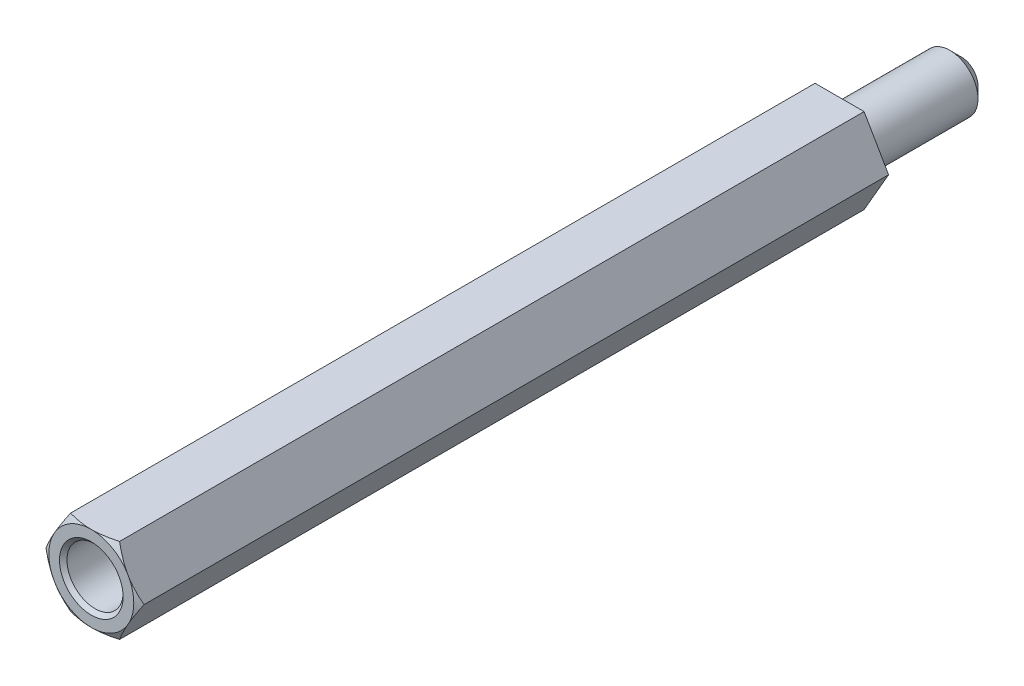
ISO-10303-21;
HEADER;
FILE_DESCRIPTION(('STEP AP214'),'2;1');
FILE_NAME('part.step','',(''),(''),'','','');
FILE_SCHEMA(('AUTOMOTIVE_DESIGN { 1 0 10303 214 1 1 1 1 }'));
ENDSEC;
DATA;
#1=APPLICATION_CONTEXT('core data for automotive mechanical design processes');
#2=APPLICATION_PROTOCOL_DEFINITION('international standard','automotive_design',2000,#1);
#3=PRODUCT_CONTEXT('',#1,'mechanical');
#4=PRODUCT('Part','Part','',(#3));
#5=PRODUCT_RELATED_PRODUCT_CATEGORY('part','',(#4));
#6=PRODUCT_DEFINITION_FORMATION('','',#4);
#7=PRODUCT_DEFINITION_CONTEXT('part definition',#1,'design');
#8=PRODUCT_DEFINITION('design','',#6,#7);
#9=PRODUCT_DEFINITION_SHAPE('','',#8);
#10=(LENGTH_UNIT() NAMED_UNIT(*) SI_UNIT(.MILLI.,.METRE.));
#11=(NAMED_UNIT(*) PLANE_ANGLE_UNIT() SI_UNIT($,.RADIAN.));
#12=(NAMED_UNIT(*) SI_UNIT($,.STERADIAN.) SOLID_ANGLE_UNIT());
#13=UNCERTAINTY_MEASURE_WITH_UNIT(LENGTH_MEASURE(1.E-05),#10,'distance_accuracy_value','');
#14=(GEOMETRIC_REPRESENTATION_CONTEXT(3) GLOBAL_UNCERTAINTY_ASSIGNED_CONTEXT((#13)) GLOBAL_UNIT_ASSIGNED_CONTEXT((#10,
#11,#12)) REPRESENTATION_CONTEXT('',''));
#15=CARTESIAN_POINT('',(0.,0.,0.));
#16=DIRECTION('',(0.,0.,1.));
#17=DIRECTION('',(1.,0.,0.));
#18=AXIS2_PLACEMENT_3D('',#15,#16,#17);
#19=CARTESIAN_POINT('',(0.,0.,40.));
#20=DIRECTION('',(0.,0.,1.));
#21=DIRECTION('',(1.,0.,0.));
#22=AXIS2_PLACEMENT_3D('',#19,#20,#21);
#23=PLANE('',#22);
#24=CARTESIAN_POINT('',(0.,0.,40.));
#25=DIRECTION('',(0.,0.,1.));
#26=DIRECTION('',(1.,0.,0.));
#27=AXIS2_PLACEMENT_3D('',#24,#25,#26);
#28=CIRCLE('',#27,1.7);
#29=CARTESIAN_POINT('',(1.7,0.,40.));
#30=VERTEX_POINT('',#29);
#31=EDGE_CURVE('E166',#30,#30,#28,.F.);
#32=ORIENTED_EDGE('',*,*,#31,.T.);
#33=EDGE_LOOP('',(#32));
#34=FACE_BOUND('',#33,.T.);
#35=CARTESIAN_POINT('',(0.,0.,40.));
#36=DIRECTION('',(0.,0.,1.));
#37=DIRECTION('',(1.,0.,0.));
#38=AXIS2_PLACEMENT_3D('',#35,#36,#37);
#39=CIRCLE('',#38,2.2711702221209);
#40=CARTESIAN_POINT('',(1.92942846272878,-1.19813187298426,40.));
#41=VERTEX_POINT('',#40);
#42=CARTESIAN_POINT('',(0.0728984077241233,-2.27,40.));
#43=VERTEX_POINT('',#42);
#44=EDGE_CURVE('E165',#41,#43,#39,.F.);
#45=ORIENTED_EDGE('',*,*,#44,.F.);
#46=DIRECTION('',(0.499999999999995,0.866025403784442,0.));
#47=VECTOR('',#46,1.);
#48=CARTESIAN_POINT('',(1.31058511106048,-2.26999999999999,40.));
#49=LINE('',#48,#47);
#50=CARTESIAN_POINT('',(2.0023268704526,-1.07186812701572,40.));
#51=VERTEX_POINT('',#50);
#52=EDGE_CURVE('E309',#41,#51,#49,.T.);
#53=ORIENTED_EDGE('',*,*,#52,.T.);
#54=CARTESIAN_POINT('',(2.00232687045273,1.07186812701549,40.));
#55=VERTEX_POINT('',#54);
#56=EDGE_CURVE('E162',#55,#51,#39,.F.);
#57=ORIENTED_EDGE('',*,*,#56,.F.);
#58=DIRECTION('',(-0.500000000000001,0.866025403784438,0.));
#59=VECTOR('',#58,1.);
#60=CARTESIAN_POINT('',(2.6211702221209,0.,40.));
#61=LINE('',#60,#59);
#62=CARTESIAN_POINT('',(1.92942846272862,1.19813187298452,40.));
#63=VERTEX_POINT('',#62);
#64=EDGE_CURVE('E321',#55,#63,#61,.T.);
#65=ORIENTED_EDGE('',*,*,#64,.T.);
#66=CARTESIAN_POINT('',(0.0728984077240917,2.27,40.));
#67=VERTEX_POINT('',#66);
#68=EDGE_CURVE('E164',#67,#63,#39,.F.);
#69=ORIENTED_EDGE('',*,*,#68,.F.);
#70=DIRECTION('',(-1.,0.,0.));
#71=VECTOR('',#70,1.);
#72=CARTESIAN_POINT('',(1.31058511106045,2.27,40.));
#73=LINE('',#72,#71);
#74=CARTESIAN_POINT('',(-0.0728984077241075,2.27,40.));
#75=VERTEX_POINT('',#74);
#76=EDGE_CURVE('E316',#67,#75,#73,.T.);
#77=ORIENTED_EDGE('',*,*,#76,.T.);
#78=CARTESIAN_POINT('',(-1.92942846272863,1.19813187298449,40.));
#79=VERTEX_POINT('',#78);
#80=EDGE_CURVE('E341',#79,#75,#39,.F.);
#81=ORIENTED_EDGE('',*,*,#80,.F.);
#82=DIRECTION('',(-0.499999999999995,-0.866025403784442,0.));
#83=VECTOR('',#82,1.);
#84=CARTESIAN_POINT('',(-1.31058511106046,2.27,40.));
#85=LINE('',#84,#83);
#86=CARTESIAN_POINT('',(-2.00232687045273,1.07186812701548,40.));
#87=VERTEX_POINT('',#86);
#88=EDGE_CURVE('E315',#79,#87,#85,.T.);
#89=ORIENTED_EDGE('',*,*,#88,.T.);
#90=CARTESIAN_POINT('',(-2.00232687045272,-1.0718681270155,40.));
#91=VERTEX_POINT('',#90);
#92=EDGE_CURVE('E126',#91,#87,#39,.F.);
#93=ORIENTED_EDGE('',*,*,#92,.F.);
#94=DIRECTION('',(0.500000000000007,-0.866025403784435,0.));
#95=VECTOR('',#94,1.);
#96=CARTESIAN_POINT('',(-2.6211702221209,0.,40.));
#97=LINE('',#96,#95);
#98=CARTESIAN_POINT('',(-1.92942846272861,-1.19813187298453,40.));
#99=VERTEX_POINT('',#98);
#100=EDGE_CURVE('E142',#91,#99,#97,.T.);
#101=ORIENTED_EDGE('',*,*,#100,.T.);
#102=CARTESIAN_POINT('',(-0.0728984077240759,-2.27,40.));
#103=VERTEX_POINT('',#102);
#104=EDGE_CURVE('E332',#103,#99,#39,.F.);
#105=ORIENTED_EDGE('',*,*,#104,.F.);
#106=DIRECTION('',(1.,0.,0.));
#107=VECTOR('',#106,1.);
#108=CARTESIAN_POINT('',(-1.31058511106043,-2.27000000000001,40.));
#109=LINE('',#108,#107);
#110=EDGE_CURVE('E301',#103,#43,#109,.T.);
#111=ORIENTED_EDGE('',*,*,#110,.T.);
#112=EDGE_LOOP('',(#45,#53,#57,#65,#69,#77,#81,#89,#93,#101,#105,#111));
#113=FACE_BOUND('',#112,.T.);
#114=ADVANCED_FACE('F37',(#34,#113),#23,.T.);
#115=CARTESIAN_POINT('',(1.31058511106048,-2.26999999999999,40.));
#116=DIRECTION('',(-0.866025403784442,0.499999999999995,0.));
#117=DIRECTION('',(-0.499999999999995,-0.866025403784442,0.));
#118=AXIS2_PLACEMENT_3D('',#115,#116,#117);
#119=PLANE('',#118);
#120=DIRECTION('',(0.,0.,-1.));
#121=VECTOR('',#120,1.);
#122=CARTESIAN_POINT('',(2.6211702221209,0.,40.));
#123=LINE('',#122,#121);
#124=CARTESIAN_POINT('',(2.6211702221209,0.,39.8));
#125=VERTEX_POINT('',#124);
#126=CARTESIAN_POINT('',(2.6211702221209,0.,0.));
#127=VERTEX_POINT('',#126);
#128=EDGE_CURVE('E160',#125,#127,#123,.T.);
#129=ORIENTED_EDGE('',*,*,#128,.F.);
#130=CARTESIAN_POINT('',(3.53192502802619,1.5774735970655,39.0874155357182));
#131=CARTESIAN_POINT('',(3.49038683177578,1.50552733070503,39.1258459368283));
#132=CARTESIAN_POINT('',(3.44875020540645,1.43341057837759,39.1638565423729));
#133=CARTESIAN_POINT('',(3.36523806633925,1.28876331046445,39.2388408708484));
#134=CARTESIAN_POINT('',(3.32336252393505,1.21623274342586,39.2758144613019));
#135=CARTESIAN_POINT('',(3.2392041639013,1.07046618796573,39.3486360571844));
#136=CARTESIAN_POINT('',(3.19692046373752,0.997228670950058,39.3844800017565));
#137=CARTESIAN_POINT('',(3.11203872815441,0.850209192285474,39.4546361454567));
#138=CARTESIAN_POINT('',(3.06944070287604,0.776427248201232,39.4889483937519));
#139=CARTESIAN_POINT('',(2.93902958582734,0.550548567601064,39.5907324723442));
#140=CARTESIAN_POINT('',(2.85063034563924,0.39743659224479,39.6552582519314));
#141=CARTESIAN_POINT('',(2.67192637782697,0.0879122404797823,39.7724545253547));
#142=CARTESIAN_POINT('',(2.58162393222904,-0.0684961833435547,39.8251384219436));
#143=CARTESIAN_POINT('',(2.42693241398783,-0.336429752437294,39.8992654299313));
#144=CARTESIAN_POINT('',(2.36310804900723,-0.44697679534452,39.9253337082215));
#145=CARTESIAN_POINT('',(2.23458545503782,-0.669584458020097,39.9666715963234));
#146=CARTESIAN_POINT('',(2.16988756118547,-0.781644497315052,39.9819452339838));
#147=CARTESIAN_POINT('',(2.04077595171338,-1.00527236476771,39.9998836306583));
#148=CARTESIAN_POINT('',(1.97636731130573,-1.1168314024002,40.0026891812466));
#149=CARTESIAN_POINT('',(1.84772217135019,-1.33965132095001,39.9957318097908));
#150=CARTESIAN_POINT('',(1.78348569252727,-1.45091216597063,39.9859674371621));
#151=CARTESIAN_POINT('',(1.63030365883246,-1.71623123113677,39.948841102754));
#152=CARTESIAN_POINT('',(1.54169424329176,-1.86970724088224,39.9160238630181));
#153=CARTESIAN_POINT('',(1.36642171508062,-2.17328816491499,39.8337386865889));
#154=CARTESIAN_POINT('',(1.27976131396277,-2.3233883826554,39.7842489190442));
#155=CARTESIAN_POINT('',(1.10733311832963,-2.62204277814944,39.6734296043507));
#156=CARTESIAN_POINT('',(1.02158612689549,-2.77056092390955,39.6119739052285));
#157=CARTESIAN_POINT('',(0.851622526986697,-3.06494651438889,39.4814839194209));
#158=CARTESIAN_POINT('',(0.76740515390728,-3.21081528344242,39.4124535477672));
#159=CARTESIAN_POINT('',(0.635892107966404,-3.43860256087016,39.2999058489882));
#160=CARTESIAN_POINT('',(0.588222071353319,-3.5211694862827,39.258115008667));
#161=CARTESIAN_POINT('',(0.493605207664309,-3.68505070144488,39.1735241810497));
#162=CARTESIAN_POINT('',(0.446655700740953,-3.76636963282644,39.1307361997354));
#163=CARTESIAN_POINT('',(0.399830305155194,-3.84747359706549,39.0874155357182));
#164=B_SPLINE_CURVE_WITH_KNOTS('',3,(#130,#131,#132,#133,#134,#135,#136,#137,#138,#139,#140,
#141,#142,#143,#144,#145,#146,#147,#148,#149,#150,#151,#152,#153,#154,#155,#156,#157,#158,#159,
#160,#161,#162,#163),.UNSPECIFIED.,.F.,.F.,(4,2,2,2,2,2,2,2,2,2,2,2,2,2,2,2,4),(0.,
0.274606048832121,0.549247019939766,0.824783021018256,1.10031017110166,1.66467514911565,
2.22839812072205,2.61888273310892,3.00922156533175,3.39514124414463,3.78110546255824,
4.32061090335238,4.8608255310685,5.40707820220995,5.95304985633501,6.26533246804876,
6.57488685439788),.UNSPECIFIED.);
#165=EDGE_CURVE('E299',#125,#51,#164,.T.);
#166=ORIENTED_EDGE('',*,*,#165,.T.);
#167=ORIENTED_EDGE('',*,*,#52,.F.);
#168=CARTESIAN_POINT('',(1.31058511106048,-2.26999999999999,39.8));
#169=VERTEX_POINT('',#168);
#170=EDGE_CURVE('E143',#41,#169,#164,.T.);
#171=ORIENTED_EDGE('',*,*,#170,.T.);
#172=DIRECTION('',(0.,0.,-1.));
#173=VECTOR('',#172,1.);
#174=CARTESIAN_POINT('',(1.31058511106048,-2.26999999999999,40.));
#175=LINE('',#174,#173);
#176=CARTESIAN_POINT('',(1.31058511106048,-2.26999999999999,0.));
#177=VERTEX_POINT('',#176);
#178=EDGE_CURVE('E155',#169,#177,#175,.T.);
#179=ORIENTED_EDGE('',*,*,#178,.T.);
#180=DIRECTION('',(0.499999999999995,0.866025403784442,0.));
#181=VECTOR('',#180,1.);
#182=CARTESIAN_POINT('',(1.31058511106048,-2.26999999999999,0.));
#183=LINE('',#182,#181);
#184=EDGE_CURVE('E287',#177,#127,#183,.T.);
#185=ORIENTED_EDGE('',*,*,#184,.T.);
#186=EDGE_LOOP('',(#129,#166,#167,#171,#179,#185));
#187=FACE_BOUND('',#186,.T.);
#188=ADVANCED_FACE('F248',(#187),#119,.F.);
#189=CARTESIAN_POINT('',(2.6211702221209,0.,40.));
#190=DIRECTION('',(-0.866025403784438,-0.500000000000001,0.));
#191=DIRECTION('',(0.500000000000001,-0.866025403784438,0.));
#192=AXIS2_PLACEMENT_3D('',#189,#190,#191);
#193=PLANE('',#192);
#194=DIRECTION('',(0.,0.,-1.));
#195=VECTOR('',#194,1.);
#196=CARTESIAN_POINT('',(1.31058511106045,2.27,40.));
#197=LINE('',#196,#195);
#198=CARTESIAN_POINT('',(1.31058511106045,2.27,39.8));
#199=VERTEX_POINT('',#198);
#200=CARTESIAN_POINT('',(1.31058511106045,2.27,0.));
#201=VERTEX_POINT('',#200);
#202=EDGE_CURVE('E153',#199,#201,#197,.T.);
#203=ORIENTED_EDGE('',*,*,#202,.F.);
#204=CARTESIAN_POINT('',(0.399830305155138,3.84747359706553,39.0874155357182));
#205=CARTESIAN_POINT('',(0.441368501405549,3.77552733070505,39.1258459368283));
#206=CARTESIAN_POINT('',(0.483005127774879,3.70341057837761,39.1638565423728));
#207=CARTESIAN_POINT('',(0.566517266842074,3.55876331046447,39.2388408708484));
#208=CARTESIAN_POINT('',(0.608392809246277,3.48623274342588,39.2758144613019));
#209=CARTESIAN_POINT('',(0.69255116928003,3.34046618796575,39.3486360571844));
#210=CARTESIAN_POINT('',(0.734834869443807,3.26722867095008,39.3844800017564));
#211=CARTESIAN_POINT('',(0.819716605026924,3.12020919228549,39.4546361454567));
#212=CARTESIAN_POINT('',(0.862314630305294,3.04642724820125,39.4889483937519));
#213=CARTESIAN_POINT('',(0.992725747353998,2.82054856760109,39.5907324723442));
#214=CARTESIAN_POINT('',(1.0811249875421,2.66743659224481,39.6552582519314));
#215=CARTESIAN_POINT('',(1.25982895535437,2.35791224047981,39.7724545253547));
#216=CARTESIAN_POINT('',(1.3501314009523,2.20150381665647,39.8251384219436));
#217=CARTESIAN_POINT('',(1.50482291919351,1.93357024756273,39.8992654299313));
#218=CARTESIAN_POINT('',(1.56864728417411,1.82302320465551,39.9253337082215));
#219=CARTESIAN_POINT('',(1.69716987814353,1.60041554197993,39.9666715963234));
#220=CARTESIAN_POINT('',(1.76186777199587,1.48835550268498,39.9819452339838));
#221=CARTESIAN_POINT('',(1.89097938146796,1.26472763523233,39.9998836306583));
#222=CARTESIAN_POINT('',(1.95538802187562,1.15316859759983,40.0026891812466));
#223=CARTESIAN_POINT('',(2.08403316183116,0.930348679050027,39.9957318097908));
#224=CARTESIAN_POINT('',(2.14826964065408,0.819087834029409,39.9859674371621));
#225=CARTESIAN_POINT('',(2.30145167434888,0.553768768863273,39.9488411027541));
#226=CARTESIAN_POINT('',(2.39006108988958,0.4002927591178,39.9160238630181));
#227=CARTESIAN_POINT('',(2.56533361810072,0.0967118350850579,39.8337386865889));
#228=CARTESIAN_POINT('',(2.65199401921857,-0.0533883826553456,39.7842489190442));
#229=CARTESIAN_POINT('',(2.82442221485171,-0.352042778149369,39.6734296043507));
#230=CARTESIAN_POINT('',(2.91016920628585,-0.500560923909477,39.6119739052286));
#231=CARTESIAN_POINT('',(3.08013280619464,-0.794946514388809,39.4814839194209));
#232=CARTESIAN_POINT('',(3.16435017927405,-0.94081528344234,39.4124535477672));
#233=CARTESIAN_POINT('',(3.29586322521494,-1.1686025608701,39.2999058489882));
#234=CARTESIAN_POINT('',(3.34353326182804,-1.25116948628265,39.258115008667));
#235=CARTESIAN_POINT('',(3.43815012551707,-1.41505070144488,39.1735241810497));
#236=CARTESIAN_POINT('',(3.48509963244044,-1.49636963282645,39.1307361997354));
#237=CARTESIAN_POINT('',(3.53192502802621,-1.57747359706552,39.0874155357182));
#238=B_SPLINE_CURVE_WITH_KNOTS('',3,(#204,#205,#206,#207,#208,#209,#210,#211,#212,#213,#214,
#215,#216,#217,#218,#219,#220,#221,#222,#223,#224,#225,#226,#227,#228,#229,#230,#231,#232,#233,
#234,#235,#236,#237),.UNSPECIFIED.,.F.,.F.,(4,2,2,2,2,2,2,2,2,2,2,2,2,2,2,2,4),(0.,
0.27460604883212,0.549247019939768,0.824783021018261,1.10031017110167,1.66467514911565,
2.22839812072206,2.61888273310893,3.00922156533175,3.39514124414463,3.78110546255825,
4.32061090335237,4.86082553106847,5.40707820220991,5.95304985633495,6.26533246804878,
6.57488685439797),.UNSPECIFIED.);
#239=EDGE_CURVE('E233',#199,#63,#238,.T.);
#240=ORIENTED_EDGE('',*,*,#239,.T.);
#241=ORIENTED_EDGE('',*,*,#64,.F.);
#242=EDGE_CURVE('E330',#55,#125,#238,.T.);
#243=ORIENTED_EDGE('',*,*,#242,.T.);
#244=ORIENTED_EDGE('',*,*,#128,.T.);
#245=DIRECTION('',(-0.500000000000001,0.866025403784438,0.));
#246=VECTOR('',#245,1.);
#247=CARTESIAN_POINT('',(2.6211702221209,0.,0.));
#248=LINE('',#247,#246);
#249=EDGE_CURVE('E292',#127,#201,#248,.T.);
#250=ORIENTED_EDGE('',*,*,#249,.T.);
#251=EDGE_LOOP('',(#203,#240,#241,#243,#244,#250));
#252=FACE_BOUND('',#251,.T.);
#253=ADVANCED_FACE('F243',(#252),#193,.F.);
#254=CARTESIAN_POINT('',(1.31058511106045,2.27,40.));
#255=DIRECTION('',(0.,-1.,0.));
#256=DIRECTION('',(1.,0.,0.));
#257=AXIS2_PLACEMENT_3D('',#254,#255,#256);
#258=PLANE('',#257);
#259=DIRECTION('',(0.,0.,-1.));
#260=VECTOR('',#259,1.);
#261=CARTESIAN_POINT('',(-1.31058511106046,2.27,40.));
#262=LINE('',#261,#260);
#263=CARTESIAN_POINT('',(-1.31058511106046,2.27,39.8));
#264=VERTEX_POINT('',#263);
#265=CARTESIAN_POINT('',(-1.31058511106046,2.27,0.));
#266=VERTEX_POINT('',#265);
#267=EDGE_CURVE('E150',#264,#266,#262,.T.);
#268=ORIENTED_EDGE('',*,*,#267,.F.);
#269=CARTESIAN_POINT('',(-2.88805870812598,2.26999999999999,39.1987324103344));
#270=CARTESIAN_POINT('',(-2.80547290408561,2.26999999999999,39.2358255324642));
#271=CARTESIAN_POINT('',(-2.72266390787582,2.26999999999999,39.2724300278097));
#272=CARTESIAN_POINT('',(-2.55650266128481,2.26999999999999,39.3444249566602));
#273=CARTESIAN_POINT('',(-2.47315031505662,2.26999999999999,39.3798151686687));
#274=CARTESIAN_POINT('',(-2.30548338672953,2.26999999999999,39.4492769222981));
#275=CARTESIAN_POINT('',(-2.22116623150816,2.26999999999999,39.4833422884396));
#276=CARTESIAN_POINT('',(-2.0518277990544,2.26999999999999,39.5496595457378));
#277=CARTESIAN_POINT('',(-1.96680655448942,2.26999999999999,39.5819115204949));
#278=CARTESIAN_POINT('',(-1.71138311857313,2.26999999999999,39.6750656041859));
#279=CARTESIAN_POINT('',(-1.53976972748373,2.26999999999999,39.7327268658694));
#280=CARTESIAN_POINT('',(-1.19280228070998,2.27,39.8349421604164));
#281=CARTESIAN_POINT('',(-1.01745424532612,2.27,39.879515794802));
#282=CARTESIAN_POINT('',(-0.712090771389087,2.27,39.9400719954737));
#283=CARTESIAN_POINT('',(-0.582987722953622,2.27,39.9605553386303));
#284=CARTESIAN_POINT('',(-0.323439084569052,2.27,39.989581233522));
#285=CARTESIAN_POINT('',(-0.192993977067343,2.27,39.9981279349084));
#286=CARTESIAN_POINT('',(0.06805994543938,2.27,40.0022273630874));
#287=CARTESIAN_POINT('',(0.198668678458185,2.27,39.9977850727737));
#288=CARTESIAN_POINT('',(0.458851198221931,2.27,39.976485692699));
#289=CARTESIAN_POINT('',(0.588424742955681,2.27,39.9596257810572));
#290=CARTESIAN_POINT('',(0.904937752962722,2.27,39.9051607953018));
#291=CARTESIAN_POINT('',(1.09083477493522,2.27,39.8615794043185));
#292=CARTESIAN_POINT('',(1.36639728986909,2.27,39.7844964765957));
#293=CARTESIAN_POINT('',(1.45781153661096,2.27,39.7568102536344));
#294=CARTESIAN_POINT('',(1.63961899594481,2.27000000000001,39.6982591090533));
#295=CARTESIAN_POINT('',(1.73001229033944,2.27000000000001,39.6673944441364));
#296=CARTESIAN_POINT('',(1.9107725748706,2.27000000000001,39.6027837141474));
#297=CARTESIAN_POINT('',(2.00113026057096,2.27000000000001,39.5690119189924));
#298=CARTESIAN_POINT('',(2.18103313876787,2.27000000000001,39.499360278944));
#299=CARTESIAN_POINT('',(2.27057828364603,2.27000000000001,39.4634803114121));
#300=CARTESIAN_POINT('',(2.44846011178725,2.27000000000001,39.3902269588395));
#301=CARTESIAN_POINT('',(2.53680076536778,2.27000000000001,39.352863166806));
#302=CARTESIAN_POINT('',(2.71286376090329,2.27000000000001,39.2767584059864));
#303=CARTESIAN_POINT('',(2.80058623966965,2.27000000000001,39.2380177541729));
#304=CARTESIAN_POINT('',(2.88805870812597,2.27000000000001,39.1987324103344));
#305=B_SPLINE_CURVE_WITH_KNOTS('',3,(#269,#270,#271,#272,#273,#274,#275,#276,#277,#278,#279,
#280,#281,#282,#283,#284,#285,#286,#287,#288,#289,#290,#291,#292,#293,#294,#295,#296,#297,#298,
#299,#300,#301,#302,#303,#304),.UNSPECIFIED.,.F.,.F.,(4,2,2,2,2,2,2,2,2,2,2,2,2,2,2,2,2,4),(0.,
0.271603728461578,0.543256739373974,0.816052841064956,1.08883635604999,1.6316315350961,
2.17360956621752,2.5653004176683,2.9568550678836,3.34825952790363,3.73975296129818,
4.31141566486302,4.59793246001128,4.88442613310069,5.17378506531958,5.46316084709716,
5.75090015934329,6.03857365362724),.UNSPECIFIED.);
#306=EDGE_CURVE('E225',#264,#75,#305,.T.);
#307=ORIENTED_EDGE('',*,*,#306,.T.);
#308=ORIENTED_EDGE('',*,*,#76,.F.);
#309=EDGE_CURVE('E232',#67,#199,#305,.T.);
#310=ORIENTED_EDGE('',*,*,#309,.T.);
#311=ORIENTED_EDGE('',*,*,#202,.T.);
#312=DIRECTION('',(-1.,0.,0.));
#313=VECTOR('',#312,1.);
#314=CARTESIAN_POINT('',(1.31058511106045,2.27,0.));
#315=LINE('',#314,#313);
#316=EDGE_CURVE('E296',#201,#266,#315,.T.);
#317=ORIENTED_EDGE('',*,*,#316,.T.);
#318=EDGE_LOOP('',(#268,#307,#308,#310,#311,#317));
#319=FACE_BOUND('',#318,.T.);
#320=ADVANCED_FACE('F240',(#319),#258,.F.);
#321=CARTESIAN_POINT('',(-1.31058511106046,2.27,40.));
#322=DIRECTION('',(0.866025403784442,-0.499999999999995,0.));
#323=DIRECTION('',(0.499999999999995,0.866025403784442,0.));
#324=AXIS2_PLACEMENT_3D('',#321,#322,#323);
#325=PLANE('',#324);
#326=DIRECTION('',(0.,0.,-1.));
#327=VECTOR('',#326,1.);
#328=CARTESIAN_POINT('',(-2.6211702221209,0.,40.));
#329=LINE('',#328,#327);
#330=CARTESIAN_POINT('',(-2.6211702221209,0.,39.8));
#331=VERTEX_POINT('',#330);
#332=CARTESIAN_POINT('',(-2.6211702221209,0.,0.));
#333=VERTEX_POINT('',#332);
#334=EDGE_CURVE('E138',#331,#333,#329,.T.);
#335=ORIENTED_EDGE('',*,*,#334,.F.);
#336=CARTESIAN_POINT('',(-3.5319250280262,-1.57747359706554,39.0874155357182));
#337=CARTESIAN_POINT('',(-3.49038683177579,-1.50552733070507,39.1258459368283));
#338=CARTESIAN_POINT('',(-3.44875020540646,-1.43341057837762,39.1638565423728));
#339=CARTESIAN_POINT('',(-3.36523806633926,-1.28876331046448,39.2388408708484));
#340=CARTESIAN_POINT('',(-3.32336252393506,-1.21623274342589,39.2758144613019));
#341=CARTESIAN_POINT('',(-3.23920416390131,-1.07046618796576,39.3486360571844));
#342=CARTESIAN_POINT('',(-3.19692046373753,-0.997228670950092,39.3844800017565));
#343=CARTESIAN_POINT('',(-3.11203872815442,-0.850209192285509,39.4546361454567));
#344=CARTESIAN_POINT('',(-3.06944070287605,-0.776427248201266,39.4889483937519));
#345=CARTESIAN_POINT('',(-2.93902958582735,-0.550548567601099,39.5907324723442));
#346=CARTESIAN_POINT('',(-2.85063034563925,-0.397436592244825,39.6552582519314));
#347=CARTESIAN_POINT('',(-2.67192637782698,-0.0879122404798165,39.7724545253547));
#348=CARTESIAN_POINT('',(-2.58162393222905,0.0684961833435212,39.8251384219436));
#349=CARTESIAN_POINT('',(-2.42693241398784,0.336429752437262,39.8992654299313));
#350=CARTESIAN_POINT('',(-2.36310804900724,0.446976795344487,39.9253337082215));
#351=CARTESIAN_POINT('',(-2.23458545503782,0.669584458020063,39.9666715963234));
#352=CARTESIAN_POINT('',(-2.16988756118548,0.781644497315017,39.9819452339838));
#353=CARTESIAN_POINT('',(-2.04077595171339,1.00527236476767,39.9998836306583));
#354=CARTESIAN_POINT('',(-1.97636731130574,1.11683140240017,40.0026891812466));
#355=CARTESIAN_POINT('',(-1.8477221713502,1.33965132094997,39.9957318097908));
#356=CARTESIAN_POINT('',(-1.78348569252728,1.45091216597059,39.9859674371621));
#357=CARTESIAN_POINT('',(-1.63030365883247,1.71623123113672,39.9488411027541));
#358=CARTESIAN_POINT('',(-1.54169424329178,1.8697072408822,39.9160238630181));
#359=CARTESIAN_POINT('',(-1.36642171508064,2.17328816491494,39.8337386865889));
#360=CARTESIAN_POINT('',(-1.2797613139628,2.32338838265535,39.7842489190442));
#361=CARTESIAN_POINT('',(-1.10733311832966,2.62204277814937,39.6734296043507));
#362=CARTESIAN_POINT('',(-1.02158612689552,2.77056092390948,39.6119739052286));
#363=CARTESIAN_POINT('',(-0.851622526986729,3.06494651438881,39.4814839194209));
#364=CARTESIAN_POINT('',(-0.767405153907315,3.21081528344235,39.4124535477672));
#365=CARTESIAN_POINT('',(-0.63589210796643,3.4386025608701,39.2999058489882));
#366=CARTESIAN_POINT('',(-0.588222071353334,3.52116948628265,39.258115008667));
#367=CARTESIAN_POINT('',(-0.493605207664302,3.68505070144488,39.1735241810497));
#368=CARTESIAN_POINT('',(-0.446655700740936,3.76636963282645,39.1307361997354));
#369=CARTESIAN_POINT('',(-0.399830305155167,3.84747359706552,39.0874155357182));
#370=B_SPLINE_CURVE_WITH_KNOTS('',3,(#336,#337,#338,#339,#340,#341,#342,#343,#344,#345,#346,
#347,#348,#349,#350,#351,#352,#353,#354,#355,#356,#357,#358,#359,#360,#361,#362,#363,#364,#365,
#366,#367,#368,#369),.UNSPECIFIED.,.F.,.F.,(4,2,2,2,2,2,2,2,2,2,2,2,2,2,2,2,4),(0.,
0.274606048832123,0.54924701993977,0.824783021018263,1.10031017110167,1.66467514911565,
2.22839812072207,2.61888273310893,3.00922156533175,3.39514124414464,3.78110546255825,
4.32061090335237,4.86082553106847,5.40707820220991,5.95304985633496,6.26533246804878,
6.57488685439796),.UNSPECIFIED.);
#371=EDGE_CURVE('E124',#331,#87,#370,.T.);
#372=ORIENTED_EDGE('',*,*,#371,.T.);
#373=ORIENTED_EDGE('',*,*,#88,.F.);
#374=EDGE_CURVE('E131',#79,#264,#370,.T.);
#375=ORIENTED_EDGE('',*,*,#374,.T.);
#376=ORIENTED_EDGE('',*,*,#267,.T.);
#377=DIRECTION('',(-0.499999999999995,-0.866025403784442,0.));
#378=VECTOR('',#377,1.);
#379=CARTESIAN_POINT('',(-1.31058511106046,2.27,0.));
#380=LINE('',#379,#378);
#381=EDGE_CURVE('E148',#266,#333,#380,.T.);
#382=ORIENTED_EDGE('',*,*,#381,.T.);
#383=EDGE_LOOP('',(#335,#372,#373,#375,#376,#382));
#384=FACE_BOUND('',#383,.T.);
#385=ADVANCED_FACE('F146',(#384),#325,.F.);
#386=CARTESIAN_POINT('',(-2.6211702221209,0.,40.));
#387=DIRECTION('',(0.866025403784435,0.500000000000007,0.));
#388=DIRECTION('',(-0.500000000000007,0.866025403784435,0.));
#389=AXIS2_PLACEMENT_3D('',#386,#387,#388);
#390=PLANE('',#389);
#391=DIRECTION('',(0.,0.,-1.));
#392=VECTOR('',#391,1.);
#393=CARTESIAN_POINT('',(-1.31058511106043,-2.27000000000001,40.));
#394=LINE('',#393,#392);
#395=CARTESIAN_POINT('',(-1.31058511106043,-2.27000000000001,39.8));
#396=VERTEX_POINT('',#395);
#397=CARTESIAN_POINT('',(-1.31058511106043,-2.27000000000001,0.));
#398=VERTEX_POINT('',#397);
#399=EDGE_CURVE('E151',#396,#398,#394,.T.);
#400=ORIENTED_EDGE('',*,*,#399,.F.);
#401=CARTESIAN_POINT('',(-0.399830305155106,-3.84747359706554,39.0874155357182));
#402=CARTESIAN_POINT('',(-0.441368501405518,-3.77552733070506,39.1258459368283));
#403=CARTESIAN_POINT('',(-0.483005127774849,-3.70341057837762,39.1638565423728));
#404=CARTESIAN_POINT('',(-0.566517266842046,-3.55876331046448,39.2388408708484));
#405=CARTESIAN_POINT('',(-0.608392809246249,-3.48623274342589,39.2758144613019));
#406=CARTESIAN_POINT('',(-0.692551169280003,-3.34046618796576,39.3486360571844));
#407=CARTESIAN_POINT('',(-0.734834869443781,-3.26722867095009,39.3844800017564));
#408=CARTESIAN_POINT('',(-0.819716605026898,-3.12020919228551,39.4546361454567));
#409=CARTESIAN_POINT('',(-0.86231463030527,-3.04642724820126,39.4889483937519));
#410=CARTESIAN_POINT('',(-0.992725747353975,-2.8205485676011,39.5907324723442));
#411=CARTESIAN_POINT('',(-1.08112498754208,-2.66743659224483,39.6552582519314));
#412=CARTESIAN_POINT('',(-1.25982895535435,-2.35791224047982,39.7724545253546));
#413=CARTESIAN_POINT('',(-1.35013140095228,-2.20150381665649,39.8251384219436));
#414=CARTESIAN_POINT('',(-1.50482291919349,-1.93357024756275,39.8992654299313));
#415=CARTESIAN_POINT('',(-1.56864728417409,-1.82302320465553,39.9253337082215));
#416=CARTESIAN_POINT('',(-1.69716987814351,-1.60041554197995,39.9666715963234));
#417=CARTESIAN_POINT('',(-1.76186777199585,-1.488355502685,39.9819452339838));
#418=CARTESIAN_POINT('',(-1.89097938146794,-1.26472763523235,39.9998836306583));
#419=CARTESIAN_POINT('',(-1.9553880218756,-1.15316859759985,40.0026891812466));
#420=CARTESIAN_POINT('',(-2.08403316183114,-0.93034867905005,39.9957318097908));
#421=CARTESIAN_POINT('',(-2.14826964065406,-0.819087834029433,39.9859674371621));
#422=CARTESIAN_POINT('',(-2.30145167434887,-0.553768768863299,39.9488411027541));
#423=CARTESIAN_POINT('',(-2.39006108988957,-0.400292759117828,39.9160238630181));
#424=CARTESIAN_POINT('',(-2.56533361810071,-0.0967118350850891,39.8337386865889));
#425=CARTESIAN_POINT('',(-2.65199401921856,0.0533883826553131,39.7842489190443));
#426=CARTESIAN_POINT('',(-2.8244222148517,0.352042778149333,39.6734296043507));
#427=CARTESIAN_POINT('',(-2.91016920628584,0.500560923909438,39.6119739052286));
#428=CARTESIAN_POINT('',(-3.08013280619463,0.794946514388768,39.4814839194209));
#429=CARTESIAN_POINT('',(-3.16435017927405,0.940815283442298,39.4124535477672));
#430=CARTESIAN_POINT('',(-3.29586322521494,1.16860256087006,39.2999058489882));
#431=CARTESIAN_POINT('',(-3.34353326182804,1.25116948628262,39.258115008667));
#432=CARTESIAN_POINT('',(-3.43815012551708,1.41505070144485,39.1735241810497));
#433=CARTESIAN_POINT('',(-3.48509963244045,1.49636963282644,39.1307361997354));
#434=CARTESIAN_POINT('',(-3.53192502802623,1.5774735970655,39.0874155357182));
#435=B_SPLINE_CURVE_WITH_KNOTS('',3,(#401,#402,#403,#404,#405,#406,#407,#408,#409,#410,#411,
#412,#413,#414,#415,#416,#417,#418,#419,#420,#421,#422,#423,#424,#425,#426,#427,#428,#429,#430,
#431,#432,#433,#434),.UNSPECIFIED.,.F.,.F.,(4,2,2,2,2,2,2,2,2,2,2,2,2,2,2,2,4),(0.,
0.274606048832125,0.549247019939774,0.824783021018265,1.10031017110167,1.66467514911566,
2.22839812072206,2.61888273310893,3.00922156533175,3.39514124414464,3.78110546255825,
4.32061090335236,4.86082553106846,5.4070782022099,5.95304985633494,6.26533246804879,
6.57488685439799),.UNSPECIFIED.);
#436=EDGE_CURVE('E145',#396,#99,#435,.T.);
#437=ORIENTED_EDGE('',*,*,#436,.T.);
#438=ORIENTED_EDGE('',*,*,#100,.F.);
#439=EDGE_CURVE('E60',#91,#331,#435,.T.);
#440=ORIENTED_EDGE('',*,*,#439,.T.);
#441=ORIENTED_EDGE('',*,*,#334,.T.);
#442=DIRECTION('',(0.500000000000007,-0.866025403784435,0.));
#443=VECTOR('',#442,1.);
#444=CARTESIAN_POINT('',(-2.6211702221209,0.,0.));
#445=LINE('',#444,#443);
#446=EDGE_CURVE('E307',#333,#398,#445,.T.);
#447=ORIENTED_EDGE('',*,*,#446,.T.);
#448=EDGE_LOOP('',(#400,#437,#438,#440,#441,#447));
#449=FACE_BOUND('',#448,.T.);
#450=ADVANCED_FACE('F136',(#449),#390,.F.);
#451=CARTESIAN_POINT('',(-1.31058511106043,-2.27000000000001,40.));
#452=DIRECTION('',(0.,1.,0.));
#453=DIRECTION('',(-1.,0.,0.));
#454=AXIS2_PLACEMENT_3D('',#451,#452,#453);
#455=PLANE('',#454);
#456=ORIENTED_EDGE('',*,*,#178,.F.);
#457=CARTESIAN_POINT('',(2.888058708126,-2.26999999999997,39.1987324103344));
#458=CARTESIAN_POINT('',(2.80547290408563,-2.26999999999997,39.2358255324642));
#459=CARTESIAN_POINT('',(2.72266390787583,-2.26999999999997,39.2724300278097));
#460=CARTESIAN_POINT('',(2.55650266128482,-2.26999999999997,39.3444249566602));
#461=CARTESIAN_POINT('',(2.47315031505664,-2.26999999999997,39.3798151686687));
#462=CARTESIAN_POINT('',(2.30548338672954,-2.26999999999998,39.4492769222981));
#463=CARTESIAN_POINT('',(2.22116623150817,-2.26999999999998,39.4833422884396));
#464=CARTESIAN_POINT('',(2.05182779905441,-2.26999999999998,39.5496595457378));
#465=CARTESIAN_POINT('',(1.96680655448944,-2.26999999999998,39.5819115204949));
#466=CARTESIAN_POINT('',(1.71138311857314,-2.26999999999998,39.6750656041859));
#467=CARTESIAN_POINT('',(1.53976972748375,-2.26999999999998,39.7327268658694));
#468=CARTESIAN_POINT('',(1.19280228071,-2.26999999999999,39.8349421604164));
#469=CARTESIAN_POINT('',(1.01745424532613,-2.26999999999999,39.879515794802));
#470=CARTESIAN_POINT('',(0.712090771389103,-2.26999999999999,39.9400719954737));
#471=CARTESIAN_POINT('',(0.582987722953637,-2.26999999999999,39.9605553386303));
#472=CARTESIAN_POINT('',(0.323439084569067,-2.27,39.989581233522));
#473=CARTESIAN_POINT('',(0.192993977067358,-2.27,39.9981279349084));
#474=CARTESIAN_POINT('',(-0.0680599454393651,-2.27,40.0022273630874));
#475=CARTESIAN_POINT('',(-0.19866867845817,-2.27,39.9977850727737));
#476=CARTESIAN_POINT('',(-0.458851198221916,-2.27,39.976485692699));
#477=CARTESIAN_POINT('',(-0.588424742955667,-2.27000000000001,39.9596257810572));
#478=CARTESIAN_POINT('',(-0.904937752962707,-2.27000000000001,39.9051607953018));
#479=CARTESIAN_POINT('',(-1.0908347749352,-2.27000000000001,39.8615794043185));
#480=CARTESIAN_POINT('',(-1.36639728986908,-2.27000000000001,39.7844964765957));
#481=CARTESIAN_POINT('',(-1.45781153661095,-2.27000000000002,39.7568102536344));
#482=CARTESIAN_POINT('',(-1.63961899594479,-2.27000000000002,39.6982591090533));
#483=CARTESIAN_POINT('',(-1.73001229033942,-2.27000000000002,39.6673944441364));
#484=CARTESIAN_POINT('',(-1.91077257487058,-2.27000000000002,39.6027837141474));
#485=CARTESIAN_POINT('',(-2.00113026057094,-2.27000000000002,39.5690119189924));
#486=CARTESIAN_POINT('',(-2.18103313876785,-2.27000000000002,39.499360278944));
#487=CARTESIAN_POINT('',(-2.27057828364601,-2.27000000000002,39.4634803114121));
#488=CARTESIAN_POINT('',(-2.44846011178723,-2.27000000000003,39.3902269588395));
#489=CARTESIAN_POINT('',(-2.53680076536776,-2.27000000000003,39.352863166806));
#490=CARTESIAN_POINT('',(-2.71286376090327,-2.27000000000003,39.2767584059864));
#491=CARTESIAN_POINT('',(-2.80058623966963,-2.27000000000003,39.2380177541729));
#492=CARTESIAN_POINT('',(-2.88805870812595,-2.27000000000003,39.1987324103344));
#493=B_SPLINE_CURVE_WITH_KNOTS('',3,(#457,#458,#459,#460,#461,#462,#463,#464,#465,#466,#467,
#468,#469,#470,#471,#472,#473,#474,#475,#476,#477,#478,#479,#480,#481,#482,#483,#484,#485,#486,
#487,#488,#489,#490,#491,#492),.UNSPECIFIED.,.F.,.F.,(4,2,2,2,2,2,2,2,2,2,2,2,2,2,2,2,2,4),(0.,
0.271603728461578,0.543256739373974,0.816052841064956,1.08883635604999,1.6316315350961,
2.17360956621752,2.5653004176683,2.9568550678836,3.34825952790363,3.73975296129818,
4.31141566486302,4.59793246001128,4.88442613310069,5.17378506531957,5.46316084709716,
5.75090015934329,6.03857365362724),.UNSPECIFIED.);
#494=EDGE_CURVE('E186',#169,#43,#493,.T.);
#495=ORIENTED_EDGE('',*,*,#494,.T.);
#496=ORIENTED_EDGE('',*,*,#110,.F.);
#497=EDGE_CURVE('E52',#103,#396,#493,.T.);
#498=ORIENTED_EDGE('',*,*,#497,.T.);
#499=ORIENTED_EDGE('',*,*,#399,.T.);
#500=DIRECTION('',(1.,0.,0.));
#501=VECTOR('',#500,1.);
#502=CARTESIAN_POINT('',(-1.31058511106043,-2.27000000000001,0.));
#503=LINE('',#502,#501);
#504=EDGE_CURVE('E289',#398,#177,#503,.T.);
#505=ORIENTED_EDGE('',*,*,#504,.T.);
#506=EDGE_LOOP('',(#456,#495,#496,#498,#499,#505));
#507=FACE_BOUND('',#506,.T.);
#508=ADVANCED_FACE('F193',(#507),#455,.F.);
#509=CARTESIAN_POINT('',(0.,0.,0.));
#510=DIRECTION('',(0.,0.,1.));
#511=DIRECTION('',(1.,0.,0.));
#512=AXIS2_PLACEMENT_3D('',#509,#510,#511);
#513=PLANE('',#512);
#514=CARTESIAN_POINT('',(0.,0.,0.));
#515=DIRECTION('',(0.,0.,-1.));
#516=DIRECTION('',(-1.,0.,0.));
#517=AXIS2_PLACEMENT_3D('',#514,#515,#516);
#518=CIRCLE('',#517,1.5);
#519=CARTESIAN_POINT('',(-1.5,0.,0.));
#520=VERTEX_POINT('',#519);
#521=EDGE_CURVE('E171',#520,#520,#518,.T.);
#522=ORIENTED_EDGE('',*,*,#521,.F.);
#523=EDGE_LOOP('',(#522));
#524=FACE_BOUND('',#523,.T.);
#525=ORIENTED_EDGE('',*,*,#184,.F.);
#526=ORIENTED_EDGE('',*,*,#504,.F.);
#527=ORIENTED_EDGE('',*,*,#446,.F.);
#528=ORIENTED_EDGE('',*,*,#381,.F.);
#529=ORIENTED_EDGE('',*,*,#316,.F.);
#530=ORIENTED_EDGE('',*,*,#249,.F.);
#531=EDGE_LOOP('',(#525,#526,#527,#528,#529,#530));
#532=FACE_BOUND('',#531,.T.);
#533=ADVANCED_FACE('F273',(#524,#532),#513,.F.);
#534=CARTESIAN_POINT('',(0.,0.,40.000012));
#535=DIRECTION('',(0.,0.,-1.));
#536=DIRECTION('',(-1.,0.,0.));
#537=AXIS2_PLACEMENT_3D('',#534,#535,#536);
#538=CYLINDRICAL_SURFACE('',#537,1.5);
#539=CARTESIAN_POINT('',(0.,0.,39.8));
#540=DIRECTION('',(0.,0.,1.));
#541=DIRECTION('',(1.,0.,0.));
#542=AXIS2_PLACEMENT_3D('',#539,#540,#541);
#543=CIRCLE('',#542,1.5);
#544=CARTESIAN_POINT('',(1.5,0.,39.8));
#545=VERTEX_POINT('',#544);
#546=EDGE_CURVE('E169',#545,#545,#543,.T.);
#547=ORIENTED_EDGE('',*,*,#546,.T.);
#548=EDGE_LOOP('',(#547));
#549=FACE_BOUND('',#548,.T.);
#550=CARTESIAN_POINT('',(0.,0.,28.));
#551=DIRECTION('',(0.,0.,1.));
#552=DIRECTION('',(1.,0.,0.));
#553=AXIS2_PLACEMENT_3D('',#550,#551,#552);
#554=CIRCLE('',#553,1.5);
#555=CARTESIAN_POINT('',(1.5,0.,28.));
#556=VERTEX_POINT('',#555);
#557=EDGE_CURVE('E294',#556,#556,#554,.T.);
#558=ORIENTED_EDGE('',*,*,#557,.F.);
#559=EDGE_LOOP('',(#558));
#560=FACE_BOUND('',#559,.T.);
#561=ADVANCED_FACE('F272',(#549,#560),#538,.F.);
#562=CARTESIAN_POINT('',(0.,0.,28.));
#563=DIRECTION('',(0.,0.,1.));
#564=DIRECTION('',(1.,0.,0.));
#565=AXIS2_PLACEMENT_3D('',#562,#563,#564);
#566=PLANE('',#565);
#567=ORIENTED_EDGE('',*,*,#557,.T.);
#568=EDGE_LOOP('',(#567));
#569=FACE_BOUND('',#568,.T.);
#570=ADVANCED_FACE('F202',(#569),#566,.T.);
#571=CARTESIAN_POINT('',(0.,0.,40.));
#572=DIRECTION('',(0.,0.,-1.));
#573=DIRECTION('',(-1.,0.,0.));
#574=AXIS2_PLACEMENT_3D('',#571,#572,#573);
#575=CONICAL_SURFACE('',#574,2.2711702221209,1.05165021254838);
#576=ORIENTED_EDGE('',*,*,#242,.F.);
#577=ORIENTED_EDGE('',*,*,#56,.T.);
#578=ORIENTED_EDGE('',*,*,#165,.F.);
#579=EDGE_LOOP('',(#576,#577,#578));
#580=FACE_BOUND('',#579,.T.);
#581=ADVANCED_FACE('F196',(#580),#575,.T.);
#582=ORIENTED_EDGE('',*,*,#309,.F.);
#583=ORIENTED_EDGE('',*,*,#68,.T.);
#584=ORIENTED_EDGE('',*,*,#239,.F.);
#585=EDGE_LOOP('',(#582,#583,#584));
#586=FACE_BOUND('',#585,.T.);
#587=ADVANCED_FACE('F201',(#586),#575,.T.);
#588=ORIENTED_EDGE('',*,*,#374,.F.);
#589=ORIENTED_EDGE('',*,*,#80,.T.);
#590=ORIENTED_EDGE('',*,*,#306,.F.);
#591=EDGE_LOOP('',(#588,#589,#590));
#592=FACE_BOUND('',#591,.T.);
#593=ADVANCED_FACE('F344',(#592),#575,.T.);
#594=ORIENTED_EDGE('',*,*,#439,.F.);
#595=ORIENTED_EDGE('',*,*,#92,.T.);
#596=ORIENTED_EDGE('',*,*,#371,.F.);
#597=EDGE_LOOP('',(#594,#595,#596));
#598=FACE_BOUND('',#597,.T.);
#599=ADVANCED_FACE('F125',(#598),#575,.T.);
#600=ORIENTED_EDGE('',*,*,#497,.F.);
#601=ORIENTED_EDGE('',*,*,#104,.T.);
#602=ORIENTED_EDGE('',*,*,#436,.F.);
#603=EDGE_LOOP('',(#600,#601,#602));
#604=FACE_BOUND('',#603,.T.);
#605=ADVANCED_FACE('F204',(#604),#575,.T.);
#606=ORIENTED_EDGE('',*,*,#44,.T.);
#607=ORIENTED_EDGE('',*,*,#494,.F.);
#608=ORIENTED_EDGE('',*,*,#170,.F.);
#609=EDGE_LOOP('',(#606,#607,#608));
#610=FACE_BOUND('',#609,.T.);
#611=ADVANCED_FACE('F255',(#610),#575,.T.);
#612=CARTESIAN_POINT('',(0.,0.,40.));
#613=DIRECTION('',(0.,0.,1.));
#614=DIRECTION('',(1.,0.,0.));
#615=AXIS2_PLACEMENT_3D('',#612,#613,#614);
#616=CONICAL_SURFACE('',#615,1.7,0.785398163397438);
#617=ORIENTED_EDGE('',*,*,#546,.F.);
#618=EDGE_LOOP('',(#617));
#619=FACE_BOUND('',#618,.T.);
#620=ORIENTED_EDGE('',*,*,#31,.F.);
#621=EDGE_LOOP('',(#620));
#622=FACE_BOUND('',#621,.T.);
#623=ADVANCED_FACE('F253',(#619,#622),#616,.F.);
#624=CARTESIAN_POINT('',(0.,0.,-6.5));
#625=DIRECTION('',(0.,0.,1.));
#626=DIRECTION('',(1.,0.,0.));
#627=AXIS2_PLACEMENT_3D('',#624,#625,#626);
#628=CYLINDRICAL_SURFACE('',#627,1.5);
#629=CARTESIAN_POINT('',(0.,0.,-5.90000000000001));
#630=DIRECTION('',(0.,0.,-1.));
#631=DIRECTION('',(-1.,0.,0.));
#632=AXIS2_PLACEMENT_3D('',#629,#630,#631);
#633=CIRCLE('',#632,1.5);
#634=CARTESIAN_POINT('',(-1.5,0.,-5.90000000000001));
#635=VERTEX_POINT('',#634);
#636=EDGE_CURVE('E11',#635,#635,#633,.F.);
#637=ORIENTED_EDGE('',*,*,#636,.T.);
#638=EDGE_LOOP('',(#637));
#639=FACE_BOUND('',#638,.T.);
#640=ORIENTED_EDGE('',*,*,#521,.T.);
#641=EDGE_LOOP('',(#640));
#642=FACE_BOUND('',#641,.T.);
#643=ADVANCED_FACE('F205',(#639,#642),#628,.T.);
#644=CARTESIAN_POINT('',(0.,0.,-6.5));
#645=DIRECTION('',(0.,0.,-1.));
#646=DIRECTION('',(-1.,0.,0.));
#647=AXIS2_PLACEMENT_3D('',#644,#645,#646);
#648=PLANE('',#647);
#649=CARTESIAN_POINT('',(0.,0.,-6.5));
#650=DIRECTION('',(0.,0.,-1.));
#651=DIRECTION('',(-1.,0.,0.));
#652=AXIS2_PLACEMENT_3D('',#649,#650,#651);
#653=CIRCLE('',#652,0.900000000000012);
#654=CARTESIAN_POINT('',(-0.900000000000012,0.,-6.5));
#655=VERTEX_POINT('',#654);
#656=EDGE_CURVE('E45',#655,#655,#653,.T.);
#657=ORIENTED_EDGE('',*,*,#656,.T.);
#658=EDGE_LOOP('',(#657));
#659=FACE_BOUND('',#658,.T.);
#660=ADVANCED_FACE('F261',(#659),#648,.T.);
#661=CARTESIAN_POINT('',(0.,0.,-6.5));
#662=DIRECTION('',(0.,0.,1.));
#663=DIRECTION('',(1.,0.,0.));
#664=AXIS2_PLACEMENT_3D('',#661,#662,#663);
#665=CONICAL_SURFACE('',#664,0.900000000000012,0.785398163397449);
#666=ORIENTED_EDGE('',*,*,#636,.F.);
#667=EDGE_LOOP('',(#666));
#668=FACE_BOUND('',#667,.T.);
#669=ORIENTED_EDGE('',*,*,#656,.F.);
#670=EDGE_LOOP('',(#669));
#671=FACE_BOUND('',#670,.T.);
#672=ADVANCED_FACE('F39',(#668,#671),#665,.T.);
#673=CLOSED_SHELL('',(#114,#188,#253,#320,#385,#450,#508,#533,#561,#570,#581,#587,#593,#599,
#605,#611,#623,#643,#660,#672));
#674=MANIFOLD_SOLID_BREP('B2',#673);
#675=ADVANCED_BREP_SHAPE_REPRESENTATION('',(#18,#674),#14);
#676=SHAPE_DEFINITION_REPRESENTATION(#9,#675);
ENDSEC;
END-ISO-10303-21;
